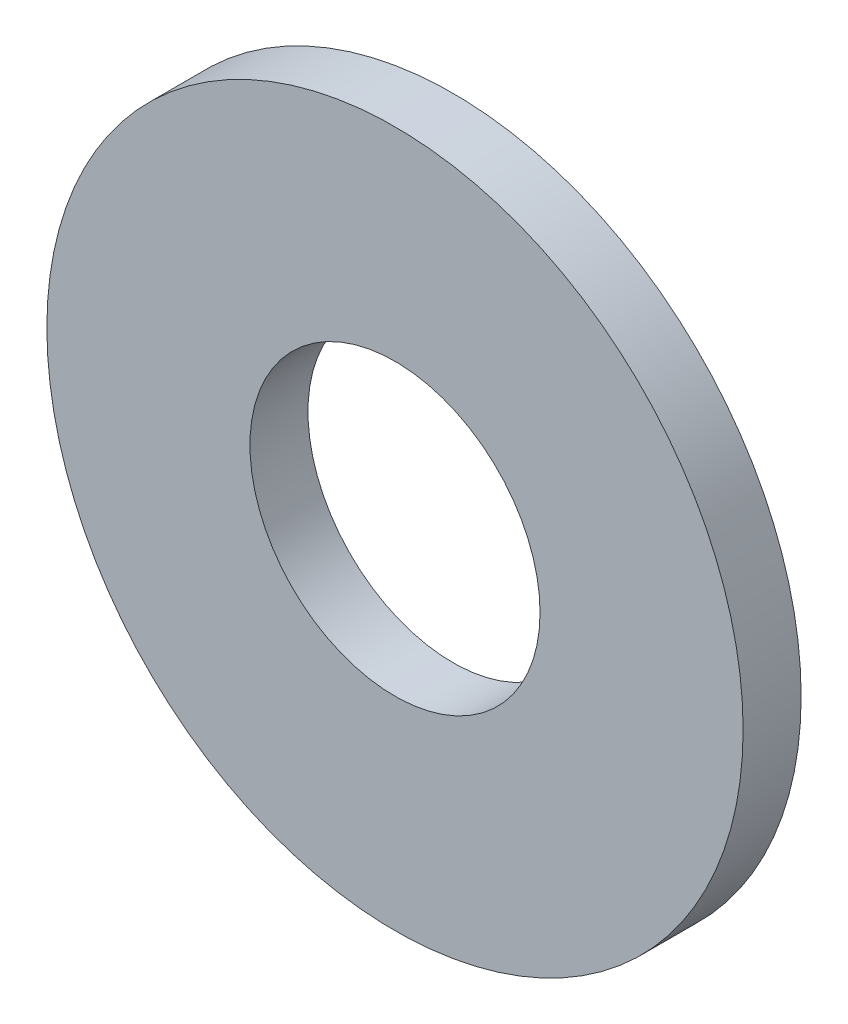
ISO-10303-21;
HEADER;
FILE_DESCRIPTION(('STEP AP214'),'2;1');
FILE_NAME('part.step','',(''),(''),'','','');
FILE_SCHEMA(('AUTOMOTIVE_DESIGN { 1 0 10303 214 1 1 1 1 }'));
ENDSEC;
DATA;
#1=APPLICATION_CONTEXT('core data for automotive mechanical design processes');
#2=APPLICATION_PROTOCOL_DEFINITION('international standard','automotive_design',2000,#1);
#3=PRODUCT_CONTEXT('',#1,'mechanical');
#4=PRODUCT('Part','Part','',(#3));
#5=PRODUCT_RELATED_PRODUCT_CATEGORY('part','',(#4));
#6=PRODUCT_DEFINITION_FORMATION('','',#4);
#7=PRODUCT_DEFINITION_CONTEXT('part definition',#1,'design');
#8=PRODUCT_DEFINITION('design','',#6,#7);
#9=PRODUCT_DEFINITION_SHAPE('','',#8);
#10=(LENGTH_UNIT() NAMED_UNIT(*) SI_UNIT(.MILLI.,.METRE.));
#11=(NAMED_UNIT(*) PLANE_ANGLE_UNIT() SI_UNIT($,.RADIAN.));
#12=(NAMED_UNIT(*) SI_UNIT($,.STERADIAN.) SOLID_ANGLE_UNIT());
#13=UNCERTAINTY_MEASURE_WITH_UNIT(LENGTH_MEASURE(1.E-05),#10,'distance_accuracy_value','');
#14=(GEOMETRIC_REPRESENTATION_CONTEXT(3) GLOBAL_UNCERTAINTY_ASSIGNED_CONTEXT((#13)) GLOBAL_UNIT_ASSIGNED_CONTEXT((#10,
#11,#12)) REPRESENTATION_CONTEXT('',''));
#15=CARTESIAN_POINT('',(0.,0.,0.));
#16=DIRECTION('',(0.,0.,1.));
#17=DIRECTION('',(1.,0.,0.));
#18=AXIS2_PLACEMENT_3D('',#15,#16,#17);
#19=CARTESIAN_POINT('',(0.,0.,1.));
#20=DIRECTION('',(0.,0.,1.));
#21=DIRECTION('',(1.,0.,0.));
#22=AXIS2_PLACEMENT_3D('',#19,#20,#21);
#23=PLANE('',#22);
#24=CARTESIAN_POINT('',(0.,0.,1.));
#25=DIRECTION('',(0.,0.,1.));
#26=DIRECTION('',(1.,0.,0.));
#27=AXIS2_PLACEMENT_3D('',#24,#25,#26);
#28=CIRCLE('',#27,6.);
#29=CARTESIAN_POINT('',(6.,0.,1.));
#30=VERTEX_POINT('',#29);
#31=EDGE_CURVE('E10',#30,#30,#28,.T.);
#32=ORIENTED_EDGE('',*,*,#31,.T.);
#33=EDGE_LOOP('',(#32));
#34=FACE_BOUND('',#33,.T.);
#35=CARTESIAN_POINT('',(0.,0.,1.));
#36=DIRECTION('',(0.,0.,1.));
#37=DIRECTION('',(1.,0.,0.));
#38=AXIS2_PLACEMENT_3D('',#35,#36,#37);
#39=CIRCLE('',#38,2.5);
#40=CARTESIAN_POINT('',(2.5,0.,1.));
#41=VERTEX_POINT('',#40);
#42=EDGE_CURVE('E44',#41,#41,#39,.T.);
#43=ORIENTED_EDGE('',*,*,#42,.F.);
#44=EDGE_LOOP('',(#43));
#45=FACE_BOUND('',#44,.T.);
#46=ADVANCED_FACE('F33',(#34,#45),#23,.T.);
#47=CARTESIAN_POINT('',(0.,0.,0.));
#48=DIRECTION('',(0.,0.,1.));
#49=DIRECTION('',(1.,0.,0.));
#50=AXIS2_PLACEMENT_3D('',#47,#48,#49);
#51=PLANE('',#50);
#52=CARTESIAN_POINT('',(0.,0.,0.));
#53=DIRECTION('',(0.,0.,1.));
#54=DIRECTION('',(1.,0.,0.));
#55=AXIS2_PLACEMENT_3D('',#52,#53,#54);
#56=CIRCLE('',#55,6.);
#57=CARTESIAN_POINT('',(6.,0.,0.));
#58=VERTEX_POINT('',#57);
#59=EDGE_CURVE('E37',#58,#58,#56,.T.);
#60=ORIENTED_EDGE('',*,*,#59,.F.);
#61=EDGE_LOOP('',(#60));
#62=FACE_BOUND('',#61,.T.);
#63=CARTESIAN_POINT('',(0.,0.,0.));
#64=DIRECTION('',(0.,0.,1.));
#65=DIRECTION('',(1.,0.,0.));
#66=AXIS2_PLACEMENT_3D('',#63,#64,#65);
#67=CIRCLE('',#66,2.5);
#68=CARTESIAN_POINT('',(2.5,0.,0.));
#69=VERTEX_POINT('',#68);
#70=EDGE_CURVE('E46',#69,#69,#67,.T.);
#71=ORIENTED_EDGE('',*,*,#70,.T.);
#72=EDGE_LOOP('',(#71));
#73=FACE_BOUND('',#72,.T.);
#74=ADVANCED_FACE('F56',(#62,#73),#51,.F.);
#75=CARTESIAN_POINT('',(0.,0.,1.));
#76=DIRECTION('',(0.,0.,-1.));
#77=DIRECTION('',(-1.,0.,0.));
#78=AXIS2_PLACEMENT_3D('',#75,#76,#77);
#79=CYLINDRICAL_SURFACE('',#78,6.);
#80=ORIENTED_EDGE('',*,*,#31,.F.);
#81=EDGE_LOOP('',(#80));
#82=FACE_BOUND('',#81,.T.);
#83=ORIENTED_EDGE('',*,*,#59,.T.);
#84=EDGE_LOOP('',(#83));
#85=FACE_BOUND('',#84,.T.);
#86=ADVANCED_FACE('F35',(#82,#85),#79,.T.);
#87=CARTESIAN_POINT('',(0.,0.,1.));
#88=DIRECTION('',(0.,0.,-1.));
#89=DIRECTION('',(-1.,0.,0.));
#90=AXIS2_PLACEMENT_3D('',#87,#88,#89);
#91=CYLINDRICAL_SURFACE('',#90,2.5);
#92=ORIENTED_EDGE('',*,*,#42,.T.);
#93=EDGE_LOOP('',(#92));
#94=FACE_BOUND('',#93,.T.);
#95=ORIENTED_EDGE('',*,*,#70,.F.);
#96=EDGE_LOOP('',(#95));
#97=FACE_BOUND('',#96,.T.);
#98=ADVANCED_FACE('F52',(#94,#97),#91,.F.);
#99=CLOSED_SHELL('',(#46,#74,#86,#98));
#100=MANIFOLD_SOLID_BREP('B2',#99);
#101=ADVANCED_BREP_SHAPE_REPRESENTATION('',(#18,#100),#14);
#102=SHAPE_DEFINITION_REPRESENTATION(#9,#101);
ENDSEC;
END-ISO-10303-21;
